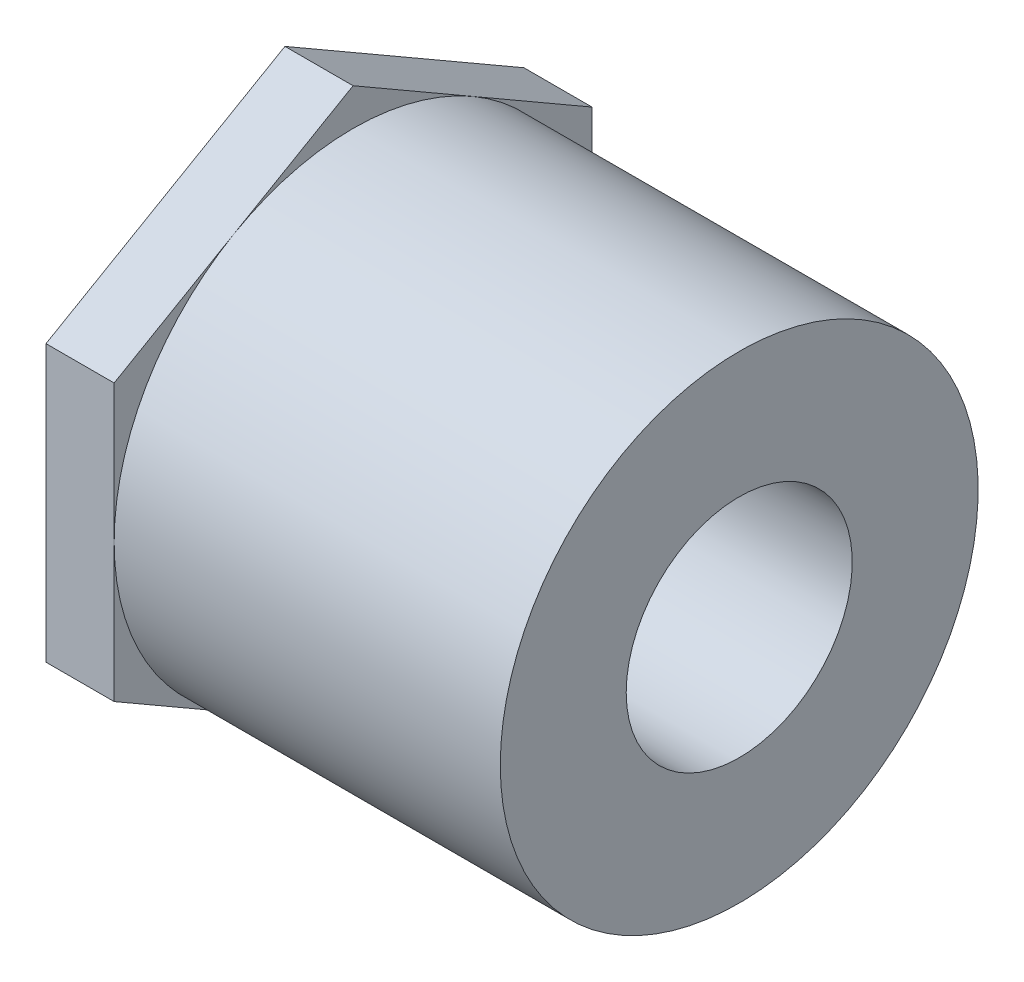
ISO-10303-21;
HEADER;
FILE_DESCRIPTION(('STEP AP214'),'2;1');
FILE_NAME('part.step','',(''),(''),'','','');
FILE_SCHEMA(('AUTOMOTIVE_DESIGN { 1 0 10303 214 1 1 1 1 }'));
ENDSEC;
DATA;
#1=APPLICATION_CONTEXT('core data for automotive mechanical design processes');
#2=APPLICATION_PROTOCOL_DEFINITION('international standard','automotive_design',2000,#1);
#3=PRODUCT_CONTEXT('',#1,'mechanical');
#4=PRODUCT('Part','Part','',(#3));
#5=PRODUCT_RELATED_PRODUCT_CATEGORY('part','',(#4));
#6=PRODUCT_DEFINITION_FORMATION('','',#4);
#7=PRODUCT_DEFINITION_CONTEXT('part definition',#1,'design');
#8=PRODUCT_DEFINITION('design','',#6,#7);
#9=PRODUCT_DEFINITION_SHAPE('','',#8);
#10=(LENGTH_UNIT() NAMED_UNIT(*) SI_UNIT(.MILLI.,.METRE.));
#11=(NAMED_UNIT(*) PLANE_ANGLE_UNIT() SI_UNIT($,.RADIAN.));
#12=(NAMED_UNIT(*) SI_UNIT($,.STERADIAN.) SOLID_ANGLE_UNIT());
#13=UNCERTAINTY_MEASURE_WITH_UNIT(LENGTH_MEASURE(1.E-05),#10,'distance_accuracy_value','');
#14=(GEOMETRIC_REPRESENTATION_CONTEXT(3) GLOBAL_UNCERTAINTY_ASSIGNED_CONTEXT((#13)) GLOBAL_UNIT_ASSIGNED_CONTEXT((#10,
#11,#12)) REPRESENTATION_CONTEXT('',''));
#15=CARTESIAN_POINT('',(0.,0.,0.));
#16=DIRECTION('',(0.,0.,1.));
#17=DIRECTION('',(1.,0.,0.));
#18=AXIS2_PLACEMENT_3D('',#15,#16,#17);
#19=CARTESIAN_POINT('',(-31.75,0.,0.));
#20=DIRECTION('',(-1.,0.,0.));
#21=DIRECTION('',(0.,0.,1.));
#22=AXIS2_PLACEMENT_3D('',#19,#20,#21);
#23=CYLINDRICAL_SURFACE('',#22,16.7005);
#24=CARTESIAN_POINT('',(0.,0.,0.));
#25=DIRECTION('',(-1.,0.,0.));
#26=DIRECTION('',(0.,0.,1.));
#27=AXIS2_PLACEMENT_3D('',#24,#25,#26);
#28=CIRCLE('',#27,16.7005);
#29=CARTESIAN_POINT('',(0.,0.,16.7005));
#30=VERTEX_POINT('',#29);
#31=EDGE_CURVE('E161',#30,#30,#28,.T.);
#32=ORIENTED_EDGE('',*,*,#31,.T.);
#33=EDGE_LOOP('',(#32));
#34=FACE_BOUND('',#33,.T.);
#35=CARTESIAN_POINT('',(-26.9875,0.,0.));
#36=DIRECTION('',(-1.,0.,0.));
#37=DIRECTION('',(0.,0.,1.));
#38=AXIS2_PLACEMENT_3D('',#35,#36,#37);
#39=CIRCLE('',#38,16.7005);
#40=CARTESIAN_POINT('',(-26.9875,14.463057255902,8.35025));
#41=VERTEX_POINT('',#40);
#42=CARTESIAN_POINT('',(-26.9875,0.,16.7005));
#43=VERTEX_POINT('',#42);
#44=EDGE_CURVE('E36',#41,#43,#39,.F.);
#45=ORIENTED_EDGE('',*,*,#44,.T.);
#46=CARTESIAN_POINT('',(-26.9875,-14.463057255902,8.35025));
#47=VERTEX_POINT('',#46);
#48=EDGE_CURVE('E11',#43,#47,#39,.F.);
#49=ORIENTED_EDGE('',*,*,#48,.T.);
#50=CARTESIAN_POINT('',(-26.9875,-14.463057255902,-8.35025));
#51=VERTEX_POINT('',#50);
#52=EDGE_CURVE('E41',#47,#51,#39,.F.);
#53=ORIENTED_EDGE('',*,*,#52,.T.);
#54=CARTESIAN_POINT('',(-26.9875,0.,-16.7005));
#55=VERTEX_POINT('',#54);
#56=EDGE_CURVE('E189',#51,#55,#39,.F.);
#57=ORIENTED_EDGE('',*,*,#56,.T.);
#58=CARTESIAN_POINT('',(-26.9875,14.463057255902,-8.35025));
#59=VERTEX_POINT('',#58);
#60=EDGE_CURVE('E188',#55,#59,#39,.F.);
#61=ORIENTED_EDGE('',*,*,#60,.T.);
#62=EDGE_CURVE('E56',#59,#41,#39,.F.);
#63=ORIENTED_EDGE('',*,*,#62,.T.);
#64=EDGE_LOOP('',(#45,#49,#53,#57,#61,#63));
#65=FACE_BOUND('',#64,.T.);
#66=ADVANCED_FACE('F32',(#34,#65),#23,.T.);
#67=CARTESIAN_POINT('',(-31.75,-16.7005,0.));
#68=DIRECTION('',(-1.,0.,0.));
#69=DIRECTION('',(0.,0.,1.));
#70=AXIS2_PLACEMENT_3D('',#67,#68,#69);
#71=PLANE('',#70);
#72=DIRECTION('',(0.,-0.5,0.866025403784439));
#73=VECTOR('',#72,1.);
#74=CARTESIAN_POINT('',(-31.75,-9.64203817060134,-16.7005));
#75=LINE('',#74,#73);
#76=CARTESIAN_POINT('',(-31.75,-9.64203817060134,-16.7005));
#77=VERTEX_POINT('',#76);
#78=CARTESIAN_POINT('',(-31.75,-19.2840763412027,0.));
#79=VERTEX_POINT('',#78);
#80=EDGE_CURVE('E152',#77,#79,#75,.T.);
#81=ORIENTED_EDGE('',*,*,#80,.T.);
#82=DIRECTION('',(0.,0.5,0.866025403784439));
#83=VECTOR('',#82,1.);
#84=CARTESIAN_POINT('',(-31.75,-19.2840763412027,0.));
#85=LINE('',#84,#83);
#86=CARTESIAN_POINT('',(-31.75,-9.64203817060135,16.7005));
#87=VERTEX_POINT('',#86);
#88=EDGE_CURVE('E155',#79,#87,#85,.T.);
#89=ORIENTED_EDGE('',*,*,#88,.T.);
#90=DIRECTION('',(0.,1.,0.));
#91=VECTOR('',#90,1.);
#92=CARTESIAN_POINT('',(-31.75,-9.64203817060135,16.7005));
#93=LINE('',#92,#91);
#94=CARTESIAN_POINT('',(-31.75,9.64203817060134,16.7005));
#95=VERTEX_POINT('',#94);
#96=EDGE_CURVE('E115',#87,#95,#93,.T.);
#97=ORIENTED_EDGE('',*,*,#96,.T.);
#98=DIRECTION('',(0.,0.5,-0.866025403784439));
#99=VECTOR('',#98,1.);
#100=CARTESIAN_POINT('',(-31.75,9.64203817060134,16.7005));
#101=LINE('',#100,#99);
#102=CARTESIAN_POINT('',(-31.75,19.2840763412027,0.));
#103=VERTEX_POINT('',#102);
#104=EDGE_CURVE('E146',#95,#103,#101,.T.);
#105=ORIENTED_EDGE('',*,*,#104,.T.);
#106=DIRECTION('',(0.,-0.5,-0.866025403784439));
#107=VECTOR('',#106,1.);
#108=CARTESIAN_POINT('',(-31.75,19.2840763412027,0.));
#109=LINE('',#108,#107);
#110=CARTESIAN_POINT('',(-31.75,9.64203817060135,-16.7005));
#111=VERTEX_POINT('',#110);
#112=EDGE_CURVE('E124',#103,#111,#109,.T.);
#113=ORIENTED_EDGE('',*,*,#112,.T.);
#114=DIRECTION('',(0.,-1.,0.));
#115=VECTOR('',#114,1.);
#116=CARTESIAN_POINT('',(-31.75,9.64203817060135,-16.7005));
#117=LINE('',#116,#115);
#118=EDGE_CURVE('E149',#111,#77,#117,.T.);
#119=ORIENTED_EDGE('',*,*,#118,.T.);
#120=EDGE_LOOP('',(#81,#89,#97,#105,#113,#119));
#121=FACE_BOUND('',#120,.T.);
#122=CARTESIAN_POINT('',(-31.75,0.,0.));
#123=DIRECTION('',(-1.,0.,0.));
#124=DIRECTION('',(0.,0.,1.));
#125=AXIS2_PLACEMENT_3D('',#122,#123,#124);
#126=CIRCLE('',#125,10.7696);
#127=CARTESIAN_POINT('',(-31.75,0.,10.7696));
#128=VERTEX_POINT('',#127);
#129=EDGE_CURVE('E182',#128,#128,#126,.T.);
#130=ORIENTED_EDGE('',*,*,#129,.F.);
#131=EDGE_LOOP('',(#130));
#132=FACE_BOUND('',#131,.T.);
#133=ADVANCED_FACE('F34',(#121,#132),#71,.T.);
#134=CARTESIAN_POINT('',(-11.90625,0.,0.));
#135=DIRECTION('',(-1.,0.,0.));
#136=DIRECTION('',(0.,0.,1.));
#137=AXIS2_PLACEMENT_3D('',#134,#135,#136);
#138=CONICAL_SURFACE('',#137,10.6172,0.00767984901039942);
#139=ORIENTED_EDGE('',*,*,#129,.T.);
#140=EDGE_LOOP('',(#139));
#141=FACE_BOUND('',#140,.T.);
#142=CARTESIAN_POINT('',(-11.90625,0.,0.));
#143=DIRECTION('',(-1.,0.,0.));
#144=DIRECTION('',(0.,0.,1.));
#145=AXIS2_PLACEMENT_3D('',#142,#143,#144);
#146=CIRCLE('',#145,10.6172);
#147=CARTESIAN_POINT('',(-11.90625,0.,10.6172));
#148=VERTEX_POINT('',#147);
#149=EDGE_CURVE('E180',#148,#148,#146,.T.);
#150=ORIENTED_EDGE('',*,*,#149,.F.);
#151=EDGE_LOOP('',(#150));
#152=FACE_BOUND('',#151,.T.);
#153=ADVANCED_FACE('F230',(#141,#152),#138,.F.);
#154=CARTESIAN_POINT('',(-11.90625,-7.8994,0.));
#155=DIRECTION('',(-1.,0.,0.));
#156=DIRECTION('',(0.,0.,1.));
#157=AXIS2_PLACEMENT_3D('',#154,#155,#156);
#158=PLANE('',#157);
#159=ORIENTED_EDGE('',*,*,#149,.T.);
#160=EDGE_LOOP('',(#159));
#161=FACE_BOUND('',#160,.T.);
#162=CARTESIAN_POINT('',(-11.90625,0.,0.));
#163=DIRECTION('',(-1.,0.,0.));
#164=DIRECTION('',(0.,0.,1.));
#165=AXIS2_PLACEMENT_3D('',#162,#163,#164);
#166=CIRCLE('',#165,7.8994);
#167=CARTESIAN_POINT('',(-11.90625,0.,7.8994));
#168=VERTEX_POINT('',#167);
#169=EDGE_CURVE('E177',#168,#168,#166,.T.);
#170=ORIENTED_EDGE('',*,*,#169,.F.);
#171=EDGE_LOOP('',(#170));
#172=FACE_BOUND('',#171,.T.);
#173=ADVANCED_FACE('F242',(#161,#172),#158,.T.);
#174=CARTESIAN_POINT('',(-31.75,0.,0.));
#175=DIRECTION('',(-1.,0.,0.));
#176=DIRECTION('',(0.,0.,1.));
#177=AXIS2_PLACEMENT_3D('',#174,#175,#176);
#178=CYLINDRICAL_SURFACE('',#177,7.8994);
#179=ORIENTED_EDGE('',*,*,#169,.T.);
#180=EDGE_LOOP('',(#179));
#181=FACE_BOUND('',#180,.T.);
#182=CARTESIAN_POINT('',(0.,0.,0.));
#183=DIRECTION('',(-1.,0.,0.));
#184=DIRECTION('',(0.,0.,1.));
#185=AXIS2_PLACEMENT_3D('',#182,#183,#184);
#186=CIRCLE('',#185,7.8994);
#187=CARTESIAN_POINT('',(0.,0.,7.8994));
#188=VERTEX_POINT('',#187);
#189=EDGE_CURVE('E174',#188,#188,#186,.T.);
#190=ORIENTED_EDGE('',*,*,#189,.F.);
#191=EDGE_LOOP('',(#190));
#192=FACE_BOUND('',#191,.T.);
#193=ADVANCED_FACE('F238',(#181,#192),#178,.F.);
#194=CARTESIAN_POINT('',(0.,-7.8994,0.));
#195=DIRECTION('',(1.,0.,0.));
#196=DIRECTION('',(0.,0.,-1.));
#197=AXIS2_PLACEMENT_3D('',#194,#195,#196);
#198=PLANE('',#197);
#199=ORIENTED_EDGE('',*,*,#189,.T.);
#200=EDGE_LOOP('',(#199));
#201=FACE_BOUND('',#200,.T.);
#202=ORIENTED_EDGE('',*,*,#31,.F.);
#203=EDGE_LOOP('',(#202));
#204=FACE_BOUND('',#203,.T.);
#205=ADVANCED_FACE('F235',(#201,#204),#198,.T.);
#206=CARTESIAN_POINT('',(-26.9875,9.64203817060134,16.7005));
#207=DIRECTION('',(0.,0.866025403784439,0.5));
#208=DIRECTION('',(0.,-0.5,0.866025403784439));
#209=AXIS2_PLACEMENT_3D('',#206,#207,#208);
#210=PLANE('',#209);
#211=DIRECTION('',(0.,0.5,-0.866025403784439));
#212=VECTOR('',#211,1.);
#213=CARTESIAN_POINT('',(-26.9875,9.64203817060134,16.7005));
#214=LINE('',#213,#212);
#215=CARTESIAN_POINT('',(-26.9875,9.64203817060134,16.7005));
#216=VERTEX_POINT('',#215);
#217=EDGE_CURVE('E114',#216,#41,#214,.T.);
#218=ORIENTED_EDGE('',*,*,#217,.T.);
#219=CARTESIAN_POINT('',(-26.9875,19.2840763412027,0.));
#220=VERTEX_POINT('',#219);
#221=EDGE_CURVE('E107',#41,#220,#214,.T.);
#222=ORIENTED_EDGE('',*,*,#221,.T.);
#223=DIRECTION('',(-1.,0.,0.));
#224=VECTOR('',#223,1.);
#225=CARTESIAN_POINT('',(-26.9875,19.2840763412027,0.));
#226=LINE('',#225,#224);
#227=EDGE_CURVE('E111',#220,#103,#226,.T.);
#228=ORIENTED_EDGE('',*,*,#227,.T.);
#229=ORIENTED_EDGE('',*,*,#104,.F.);
#230=DIRECTION('',(-1.,0.,0.));
#231=VECTOR('',#230,1.);
#232=CARTESIAN_POINT('',(-26.9875,9.64203817060134,16.7005));
#233=LINE('',#232,#231);
#234=EDGE_CURVE('E158',#216,#95,#233,.T.);
#235=ORIENTED_EDGE('',*,*,#234,.F.);
#236=EDGE_LOOP('',(#218,#222,#228,#229,#235));
#237=FACE_BOUND('',#236,.T.);
#238=ADVANCED_FACE('F109',(#237),#210,.T.);
#239=CARTESIAN_POINT('',(-26.9875,-9.64203817060135,16.7005));
#240=DIRECTION('',(0.,0.,1.));
#241=DIRECTION('',(0.,-1.,0.));
#242=AXIS2_PLACEMENT_3D('',#239,#240,#241);
#243=PLANE('',#242);
#244=DIRECTION('',(0.,1.,0.));
#245=VECTOR('',#244,1.);
#246=CARTESIAN_POINT('',(-26.9875,-9.64203817060135,16.7005));
#247=LINE('',#246,#245);
#248=CARTESIAN_POINT('',(-26.9875,-9.64203817060135,16.7005));
#249=VERTEX_POINT('',#248);
#250=EDGE_CURVE('E48',#249,#43,#247,.T.);
#251=ORIENTED_EDGE('',*,*,#250,.T.);
#252=EDGE_CURVE('E144',#43,#216,#247,.T.);
#253=ORIENTED_EDGE('',*,*,#252,.T.);
#254=ORIENTED_EDGE('',*,*,#234,.T.);
#255=ORIENTED_EDGE('',*,*,#96,.F.);
#256=DIRECTION('',(-1.,0.,0.));
#257=VECTOR('',#256,1.);
#258=CARTESIAN_POINT('',(-26.9875,-9.64203817060135,16.7005));
#259=LINE('',#258,#257);
#260=EDGE_CURVE('E162',#249,#87,#259,.T.);
#261=ORIENTED_EDGE('',*,*,#260,.F.);
#262=EDGE_LOOP('',(#251,#253,#254,#255,#261));
#263=FACE_BOUND('',#262,.T.);
#264=ADVANCED_FACE('F277',(#263),#243,.T.);
#265=CARTESIAN_POINT('',(-26.9875,-19.2840763412027,0.));
#266=DIRECTION('',(0.,-0.866025403784439,0.5));
#267=DIRECTION('',(0.,-0.5,-0.866025403784439));
#268=AXIS2_PLACEMENT_3D('',#265,#266,#267);
#269=PLANE('',#268);
#270=DIRECTION('',(0.,0.5,0.866025403784439));
#271=VECTOR('',#270,1.);
#272=CARTESIAN_POINT('',(-26.9875,-19.2840763412027,0.));
#273=LINE('',#272,#271);
#274=CARTESIAN_POINT('',(-26.9875,-19.2840763412027,0.));
#275=VERTEX_POINT('',#274);
#276=EDGE_CURVE('E141',#275,#47,#273,.T.);
#277=ORIENTED_EDGE('',*,*,#276,.T.);
#278=EDGE_CURVE('E140',#47,#249,#273,.T.);
#279=ORIENTED_EDGE('',*,*,#278,.T.);
#280=ORIENTED_EDGE('',*,*,#260,.T.);
#281=ORIENTED_EDGE('',*,*,#88,.F.);
#282=DIRECTION('',(-1.,0.,0.));
#283=VECTOR('',#282,1.);
#284=CARTESIAN_POINT('',(-26.9875,-19.2840763412027,0.));
#285=LINE('',#284,#283);
#286=EDGE_CURVE('E165',#275,#79,#285,.T.);
#287=ORIENTED_EDGE('',*,*,#286,.F.);
#288=EDGE_LOOP('',(#277,#279,#280,#281,#287));
#289=FACE_BOUND('',#288,.T.);
#290=ADVANCED_FACE('F202',(#289),#269,.T.);
#291=CARTESIAN_POINT('',(-26.9875,-9.64203817060134,-16.7005));
#292=DIRECTION('',(0.,-0.866025403784439,-0.5));
#293=DIRECTION('',(0.,0.5,-0.866025403784439));
#294=AXIS2_PLACEMENT_3D('',#291,#292,#293);
#295=PLANE('',#294);
#296=DIRECTION('',(0.,-0.5,0.866025403784439));
#297=VECTOR('',#296,1.);
#298=CARTESIAN_POINT('',(-26.9875,-9.64203817060134,-16.7005));
#299=LINE('',#298,#297);
#300=CARTESIAN_POINT('',(-26.9875,-9.64203817060134,-16.7005));
#301=VERTEX_POINT('',#300);
#302=EDGE_CURVE('E137',#301,#51,#299,.T.);
#303=ORIENTED_EDGE('',*,*,#302,.T.);
#304=EDGE_CURVE('E136',#51,#275,#299,.T.);
#305=ORIENTED_EDGE('',*,*,#304,.T.);
#306=ORIENTED_EDGE('',*,*,#286,.T.);
#307=ORIENTED_EDGE('',*,*,#80,.F.);
#308=DIRECTION('',(-1.,0.,0.));
#309=VECTOR('',#308,1.);
#310=CARTESIAN_POINT('',(-26.9875,-9.64203817060134,-16.7005));
#311=LINE('',#310,#309);
#312=EDGE_CURVE('E168',#301,#77,#311,.T.);
#313=ORIENTED_EDGE('',*,*,#312,.F.);
#314=EDGE_LOOP('',(#303,#305,#306,#307,#313));
#315=FACE_BOUND('',#314,.T.);
#316=ADVANCED_FACE('F204',(#315),#295,.T.);
#317=CARTESIAN_POINT('',(-26.9875,9.64203817060135,-16.7005));
#318=DIRECTION('',(0.,0.,-1.));
#319=DIRECTION('',(0.,1.,0.));
#320=AXIS2_PLACEMENT_3D('',#317,#318,#319);
#321=PLANE('',#320);
#322=DIRECTION('',(0.,-1.,0.));
#323=VECTOR('',#322,1.);
#324=CARTESIAN_POINT('',(-26.9875,9.64203817060135,-16.7005));
#325=LINE('',#324,#323);
#326=CARTESIAN_POINT('',(-26.9875,9.64203817060135,-16.7005));
#327=VERTEX_POINT('',#326);
#328=EDGE_CURVE('E132',#327,#55,#325,.T.);
#329=ORIENTED_EDGE('',*,*,#328,.T.);
#330=EDGE_CURVE('E129',#55,#301,#325,.T.);
#331=ORIENTED_EDGE('',*,*,#330,.T.);
#332=ORIENTED_EDGE('',*,*,#312,.T.);
#333=ORIENTED_EDGE('',*,*,#118,.F.);
#334=DIRECTION('',(-1.,0.,0.));
#335=VECTOR('',#334,1.);
#336=CARTESIAN_POINT('',(-26.9875,9.64203817060135,-16.7005));
#337=LINE('',#336,#335);
#338=EDGE_CURVE('E126',#327,#111,#337,.T.);
#339=ORIENTED_EDGE('',*,*,#338,.F.);
#340=EDGE_LOOP('',(#329,#331,#332,#333,#339));
#341=FACE_BOUND('',#340,.T.);
#342=ADVANCED_FACE('F213',(#341),#321,.T.);
#343=CARTESIAN_POINT('',(-26.9875,19.2840763412027,0.));
#344=DIRECTION('',(0.,0.866025403784439,-0.5));
#345=DIRECTION('',(0.,0.5,0.866025403784439));
#346=AXIS2_PLACEMENT_3D('',#343,#344,#345);
#347=PLANE('',#346);
#348=DIRECTION('',(0.,-0.5,-0.866025403784439));
#349=VECTOR('',#348,1.);
#350=CARTESIAN_POINT('',(-26.9875,19.2840763412027,0.));
#351=LINE('',#350,#349);
#352=EDGE_CURVE('E120',#220,#59,#351,.T.);
#353=ORIENTED_EDGE('',*,*,#352,.T.);
#354=EDGE_CURVE('E130',#59,#327,#351,.T.);
#355=ORIENTED_EDGE('',*,*,#354,.T.);
#356=ORIENTED_EDGE('',*,*,#338,.T.);
#357=ORIENTED_EDGE('',*,*,#112,.F.);
#358=ORIENTED_EDGE('',*,*,#227,.F.);
#359=EDGE_LOOP('',(#353,#355,#356,#357,#358));
#360=FACE_BOUND('',#359,.T.);
#361=ADVANCED_FACE('F119',(#360),#347,.T.);
#362=CARTESIAN_POINT('',(-26.9875,19.2840763412027,0.));
#363=DIRECTION('',(-1.,0.,0.));
#364=DIRECTION('',(0.,0.,1.));
#365=AXIS2_PLACEMENT_3D('',#362,#363,#364);
#366=PLANE('',#365);
#367=ORIENTED_EDGE('',*,*,#48,.F.);
#368=ORIENTED_EDGE('',*,*,#250,.F.);
#369=ORIENTED_EDGE('',*,*,#278,.F.);
#370=EDGE_LOOP('',(#367,#368,#369));
#371=FACE_BOUND('',#370,.T.);
#372=ADVANCED_FACE('F199',(#371),#366,.F.);
#373=ORIENTED_EDGE('',*,*,#52,.F.);
#374=ORIENTED_EDGE('',*,*,#276,.F.);
#375=ORIENTED_EDGE('',*,*,#304,.F.);
#376=EDGE_LOOP('',(#373,#374,#375));
#377=FACE_BOUND('',#376,.T.);
#378=ADVANCED_FACE('F197',(#377),#366,.F.);
#379=ORIENTED_EDGE('',*,*,#56,.F.);
#380=ORIENTED_EDGE('',*,*,#302,.F.);
#381=ORIENTED_EDGE('',*,*,#330,.F.);
#382=EDGE_LOOP('',(#379,#380,#381));
#383=FACE_BOUND('',#382,.T.);
#384=ADVANCED_FACE('F209',(#383),#366,.F.);
#385=ORIENTED_EDGE('',*,*,#60,.F.);
#386=ORIENTED_EDGE('',*,*,#328,.F.);
#387=ORIENTED_EDGE('',*,*,#354,.F.);
#388=EDGE_LOOP('',(#385,#386,#387));
#389=FACE_BOUND('',#388,.T.);
#390=ADVANCED_FACE('F215',(#389),#366,.F.);
#391=ORIENTED_EDGE('',*,*,#62,.F.);
#392=ORIENTED_EDGE('',*,*,#352,.F.);
#393=ORIENTED_EDGE('',*,*,#221,.F.);
#394=EDGE_LOOP('',(#391,#392,#393));
#395=FACE_BOUND('',#394,.T.);
#396=ADVANCED_FACE('F128',(#395),#366,.F.);
#397=ORIENTED_EDGE('',*,*,#44,.F.);
#398=ORIENTED_EDGE('',*,*,#217,.F.);
#399=ORIENTED_EDGE('',*,*,#252,.F.);
#400=EDGE_LOOP('',(#397,#398,#399));
#401=FACE_BOUND('',#400,.T.);
#402=ADVANCED_FACE('F222',(#401),#366,.F.);
#403=CLOSED_SHELL('',(#66,#133,#153,#173,#193,#205,#238,#264,#290,#316,#342,#361,#372,#378,#384,
#390,#396,#402));
#404=MANIFOLD_SOLID_BREP('B2',#403);
#405=ADVANCED_BREP_SHAPE_REPRESENTATION('',(#18,#404),#14);
#406=SHAPE_DEFINITION_REPRESENTATION(#9,#405);
ENDSEC;
END-ISO-10303-21;
